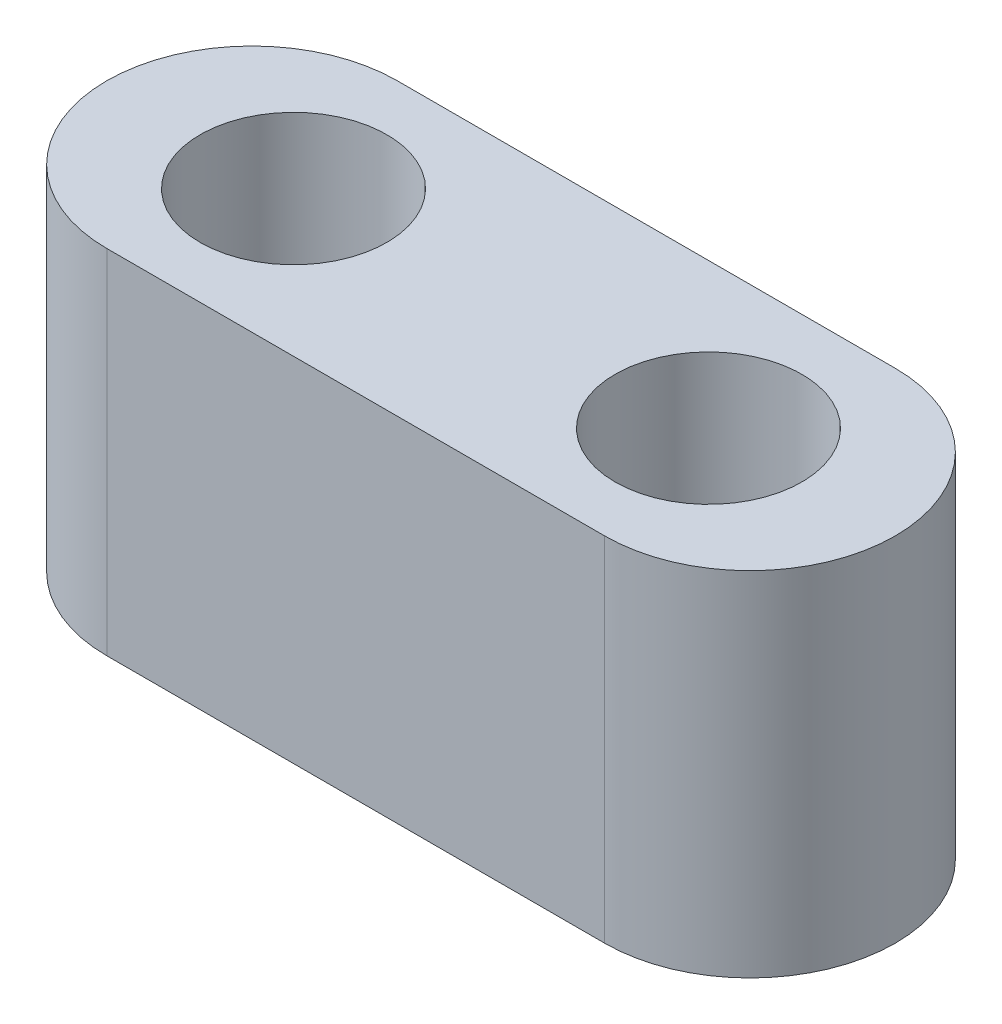
ISO-10303-21;
HEADER;
FILE_DESCRIPTION(('STEP AP214'),'2;1');
FILE_NAME('part.step','',(''),(''),'','','');
FILE_SCHEMA(('AUTOMOTIVE_DESIGN { 1 0 10303 214 1 1 1 1 }'));
ENDSEC;
DATA;
#1=APPLICATION_CONTEXT('core data for automotive mechanical design processes');
#2=APPLICATION_PROTOCOL_DEFINITION('international standard','automotive_design',2000,#1);
#3=PRODUCT_CONTEXT('',#1,'mechanical');
#4=PRODUCT('Part','Part','',(#3));
#5=PRODUCT_RELATED_PRODUCT_CATEGORY('part','',(#4));
#6=PRODUCT_DEFINITION_FORMATION('','',#4);
#7=PRODUCT_DEFINITION_CONTEXT('part definition',#1,'design');
#8=PRODUCT_DEFINITION('design','',#6,#7);
#9=PRODUCT_DEFINITION_SHAPE('','',#8);
#10=(LENGTH_UNIT() NAMED_UNIT(*) SI_UNIT(.MILLI.,.METRE.));
#11=(NAMED_UNIT(*) PLANE_ANGLE_UNIT() SI_UNIT($,.RADIAN.));
#12=(NAMED_UNIT(*) SI_UNIT($,.STERADIAN.) SOLID_ANGLE_UNIT());
#13=UNCERTAINTY_MEASURE_WITH_UNIT(LENGTH_MEASURE(1.E-05),#10,'distance_accuracy_value','');
#14=(GEOMETRIC_REPRESENTATION_CONTEXT(3) GLOBAL_UNCERTAINTY_ASSIGNED_CONTEXT((#13)) GLOBAL_UNIT_ASSIGNED_CONTEXT((#10,
#11,#12)) REPRESENTATION_CONTEXT('',''));
#15=CARTESIAN_POINT('',(0.,0.,0.));
#16=DIRECTION('',(0.,0.,1.));
#17=DIRECTION('',(1.,0.,0.));
#18=AXIS2_PLACEMENT_3D('',#15,#16,#17);
#19=CARTESIAN_POINT('',(-6.,8.5,0.));
#20=DIRECTION('',(0.,1.,0.));
#21=DIRECTION('',(0.,0.,1.));
#22=AXIS2_PLACEMENT_3D('',#19,#20,#21);
#23=PLANE('',#22);
#24=CARTESIAN_POINT('',(5.,8.5,0.));
#25=DIRECTION('',(0.,1.,0.));
#26=DIRECTION('',(0.,0.,1.));
#27=AXIS2_PLACEMENT_3D('',#24,#25,#26);
#28=CIRCLE('',#27,2.25);
#29=CARTESIAN_POINT('',(5.,8.5,2.25));
#30=VERTEX_POINT('',#29);
#31=EDGE_CURVE('E116',#30,#30,#28,.T.);
#32=ORIENTED_EDGE('',*,*,#31,.F.);
#33=EDGE_LOOP('',(#32));
#34=FACE_BOUND('',#33,.T.);
#35=CARTESIAN_POINT('',(-6.,8.5,0.));
#36=DIRECTION('',(0.,1.,0.));
#37=DIRECTION('',(0.,0.,1.));
#38=AXIS2_PLACEMENT_3D('',#35,#36,#37);
#39=CIRCLE('',#38,3.5);
#40=CARTESIAN_POINT('',(-6.,8.5,-3.5));
#41=VERTEX_POINT('',#40);
#42=CARTESIAN_POINT('',(-6.,8.5,3.5));
#43=VERTEX_POINT('',#42);
#44=EDGE_CURVE('E96',#41,#43,#39,.T.);
#45=ORIENTED_EDGE('',*,*,#44,.T.);
#46=DIRECTION('',(1.,0.,0.));
#47=VECTOR('',#46,1.);
#48=CARTESIAN_POINT('',(-6.,8.5,3.5));
#49=LINE('',#48,#47);
#50=CARTESIAN_POINT('',(6.,8.5,3.5));
#51=VERTEX_POINT('',#50);
#52=EDGE_CURVE('E91',#43,#51,#49,.T.);
#53=ORIENTED_EDGE('',*,*,#52,.T.);
#54=CARTESIAN_POINT('',(6.,8.5,0.));
#55=DIRECTION('',(0.,1.,0.));
#56=DIRECTION('',(0.,0.,1.));
#57=AXIS2_PLACEMENT_3D('',#54,#55,#56);
#58=CIRCLE('',#57,3.5);
#59=CARTESIAN_POINT('',(6.,8.5,-3.5));
#60=VERTEX_POINT('',#59);
#61=EDGE_CURVE('E94',#51,#60,#58,.T.);
#62=ORIENTED_EDGE('',*,*,#61,.T.);
#63=DIRECTION('',(-1.,0.,0.));
#64=VECTOR('',#63,1.);
#65=CARTESIAN_POINT('',(-6.,8.5,-3.5));
#66=LINE('',#65,#64);
#67=EDGE_CURVE('E61',#60,#41,#66,.T.);
#68=ORIENTED_EDGE('',*,*,#67,.T.);
#69=EDGE_LOOP('',(#45,#53,#62,#68));
#70=FACE_BOUND('',#69,.T.);
#71=CARTESIAN_POINT('',(-5.,8.5,0.));
#72=DIRECTION('',(0.,1.,0.));
#73=DIRECTION('',(0.,0.,1.));
#74=AXIS2_PLACEMENT_3D('',#71,#72,#73);
#75=CIRCLE('',#74,2.25);
#76=CARTESIAN_POINT('',(-5.,8.5,2.25));
#77=VERTEX_POINT('',#76);
#78=EDGE_CURVE('E138',#77,#77,#75,.T.);
#79=ORIENTED_EDGE('',*,*,#78,.F.);
#80=EDGE_LOOP('',(#79));
#81=FACE_BOUND('',#80,.T.);
#82=ADVANCED_FACE('F43',(#34,#70,#81),#23,.T.);
#83=CARTESIAN_POINT('',(-6.,0.,0.));
#84=DIRECTION('',(0.,1.,0.));
#85=DIRECTION('',(0.,0.,1.));
#86=AXIS2_PLACEMENT_3D('',#83,#84,#85);
#87=PLANE('',#86);
#88=CARTESIAN_POINT('',(-6.,0.,0.));
#89=DIRECTION('',(0.,1.,0.));
#90=DIRECTION('',(0.,0.,1.));
#91=AXIS2_PLACEMENT_3D('',#88,#89,#90);
#92=CIRCLE('',#91,3.5);
#93=CARTESIAN_POINT('',(-6.,0.,-3.5));
#94=VERTEX_POINT('',#93);
#95=CARTESIAN_POINT('',(-6.,0.,3.5));
#96=VERTEX_POINT('',#95);
#97=EDGE_CURVE('E112',#94,#96,#92,.T.);
#98=ORIENTED_EDGE('',*,*,#97,.F.);
#99=DIRECTION('',(-1.,0.,0.));
#100=VECTOR('',#99,1.);
#101=CARTESIAN_POINT('',(-6.,0.,-3.5));
#102=LINE('',#101,#100);
#103=CARTESIAN_POINT('',(6.,0.,-3.5));
#104=VERTEX_POINT('',#103);
#105=EDGE_CURVE('E84',#104,#94,#102,.T.);
#106=ORIENTED_EDGE('',*,*,#105,.F.);
#107=CARTESIAN_POINT('',(6.,0.,0.));
#108=DIRECTION('',(0.,1.,0.));
#109=DIRECTION('',(0.,0.,1.));
#110=AXIS2_PLACEMENT_3D('',#107,#108,#109);
#111=CIRCLE('',#110,3.5);
#112=CARTESIAN_POINT('',(6.,0.,3.5));
#113=VERTEX_POINT('',#112);
#114=EDGE_CURVE('E78',#113,#104,#111,.T.);
#115=ORIENTED_EDGE('',*,*,#114,.F.);
#116=DIRECTION('',(1.,0.,0.));
#117=VECTOR('',#116,1.);
#118=CARTESIAN_POINT('',(-6.,0.,3.5));
#119=LINE('',#118,#117);
#120=EDGE_CURVE('E101',#96,#113,#119,.T.);
#121=ORIENTED_EDGE('',*,*,#120,.F.);
#122=EDGE_LOOP('',(#98,#106,#115,#121));
#123=FACE_BOUND('',#122,.T.);
#124=CARTESIAN_POINT('',(5.,0.,0.));
#125=DIRECTION('',(0.,1.,0.));
#126=DIRECTION('',(0.,0.,1.));
#127=AXIS2_PLACEMENT_3D('',#124,#125,#126);
#128=CIRCLE('',#127,2.25);
#129=CARTESIAN_POINT('',(5.,0.,2.25));
#130=VERTEX_POINT('',#129);
#131=EDGE_CURVE('E134',#130,#130,#128,.T.);
#132=ORIENTED_EDGE('',*,*,#131,.T.);
#133=EDGE_LOOP('',(#132));
#134=FACE_BOUND('',#133,.T.);
#135=CARTESIAN_POINT('',(-5.,0.,0.));
#136=DIRECTION('',(0.,1.,0.));
#137=DIRECTION('',(0.,0.,1.));
#138=AXIS2_PLACEMENT_3D('',#135,#136,#137);
#139=CIRCLE('',#138,2.25);
#140=CARTESIAN_POINT('',(-5.,0.,2.25));
#141=VERTEX_POINT('',#140);
#142=EDGE_CURVE('E142',#141,#141,#139,.T.);
#143=ORIENTED_EDGE('',*,*,#142,.T.);
#144=EDGE_LOOP('',(#143));
#145=FACE_BOUND('',#144,.T.);
#146=ADVANCED_FACE('F129',(#123,#134,#145),#87,.F.);
#147=CARTESIAN_POINT('',(-6.,8.5,0.));
#148=DIRECTION('',(0.,-1.,0.));
#149=DIRECTION('',(0.,0.,-1.));
#150=AXIS2_PLACEMENT_3D('',#147,#148,#149);
#151=CYLINDRICAL_SURFACE('',#150,3.5);
#152=ORIENTED_EDGE('',*,*,#97,.T.);
#153=DIRECTION('',(0.,-1.,0.));
#154=VECTOR('',#153,1.);
#155=CARTESIAN_POINT('',(-6.,8.5,3.5));
#156=LINE('',#155,#154);
#157=EDGE_CURVE('E11',#43,#96,#156,.T.);
#158=ORIENTED_EDGE('',*,*,#157,.F.);
#159=ORIENTED_EDGE('',*,*,#44,.F.);
#160=DIRECTION('',(0.,-1.,0.));
#161=VECTOR('',#160,1.);
#162=CARTESIAN_POINT('',(-6.,8.5,-3.5));
#163=LINE('',#162,#161);
#164=EDGE_CURVE('E108',#41,#94,#163,.T.);
#165=ORIENTED_EDGE('',*,*,#164,.T.);
#166=EDGE_LOOP('',(#152,#158,#159,#165));
#167=FACE_BOUND('',#166,.T.);
#168=ADVANCED_FACE('F45',(#167),#151,.T.);
#169=CARTESIAN_POINT('',(-6.,8.5,3.5));
#170=DIRECTION('',(0.,0.,-1.));
#171=DIRECTION('',(-1.,0.,0.));
#172=AXIS2_PLACEMENT_3D('',#169,#170,#171);
#173=PLANE('',#172);
#174=ORIENTED_EDGE('',*,*,#120,.T.);
#175=DIRECTION('',(0.,-1.,0.));
#176=VECTOR('',#175,1.);
#177=CARTESIAN_POINT('',(6.,8.5,3.5));
#178=LINE('',#177,#176);
#179=EDGE_CURVE('E53',#51,#113,#178,.T.);
#180=ORIENTED_EDGE('',*,*,#179,.F.);
#181=ORIENTED_EDGE('',*,*,#52,.F.);
#182=ORIENTED_EDGE('',*,*,#157,.T.);
#183=EDGE_LOOP('',(#174,#180,#181,#182));
#184=FACE_BOUND('',#183,.T.);
#185=ADVANCED_FACE('F100',(#184),#173,.F.);
#186=CARTESIAN_POINT('',(6.,8.5,0.));
#187=DIRECTION('',(0.,-1.,0.));
#188=DIRECTION('',(0.,0.,-1.));
#189=AXIS2_PLACEMENT_3D('',#186,#187,#188);
#190=CYLINDRICAL_SURFACE('',#189,3.5);
#191=ORIENTED_EDGE('',*,*,#114,.T.);
#192=DIRECTION('',(0.,-1.,0.));
#193=VECTOR('',#192,1.);
#194=CARTESIAN_POINT('',(6.,8.5,-3.5));
#195=LINE('',#194,#193);
#196=EDGE_CURVE('E103',#60,#104,#195,.T.);
#197=ORIENTED_EDGE('',*,*,#196,.F.);
#198=ORIENTED_EDGE('',*,*,#61,.F.);
#199=ORIENTED_EDGE('',*,*,#179,.T.);
#200=EDGE_LOOP('',(#191,#197,#198,#199));
#201=FACE_BOUND('',#200,.T.);
#202=ADVANCED_FACE('F104',(#201),#190,.T.);
#203=CARTESIAN_POINT('',(-6.,8.5,-3.5));
#204=DIRECTION('',(0.,0.,1.));
#205=DIRECTION('',(1.,0.,0.));
#206=AXIS2_PLACEMENT_3D('',#203,#204,#205);
#207=PLANE('',#206);
#208=ORIENTED_EDGE('',*,*,#105,.T.);
#209=ORIENTED_EDGE('',*,*,#164,.F.);
#210=ORIENTED_EDGE('',*,*,#67,.F.);
#211=ORIENTED_EDGE('',*,*,#196,.T.);
#212=EDGE_LOOP('',(#208,#209,#210,#211));
#213=FACE_BOUND('',#212,.T.);
#214=ADVANCED_FACE('F126',(#213),#207,.F.);
#215=CARTESIAN_POINT('',(5.,8.5,0.));
#216=DIRECTION('',(0.,-1.,0.));
#217=DIRECTION('',(0.,0.,-1.));
#218=AXIS2_PLACEMENT_3D('',#215,#216,#217);
#219=CYLINDRICAL_SURFACE('',#218,2.25);
#220=ORIENTED_EDGE('',*,*,#31,.T.);
#221=EDGE_LOOP('',(#220));
#222=FACE_BOUND('',#221,.T.);
#223=ORIENTED_EDGE('',*,*,#131,.F.);
#224=EDGE_LOOP('',(#223));
#225=FACE_BOUND('',#224,.T.);
#226=ADVANCED_FACE('F161',(#222,#225),#219,.F.);
#227=CARTESIAN_POINT('',(-5.,8.5,0.));
#228=DIRECTION('',(0.,-1.,0.));
#229=DIRECTION('',(0.,0.,-1.));
#230=AXIS2_PLACEMENT_3D('',#227,#228,#229);
#231=CYLINDRICAL_SURFACE('',#230,2.25);
#232=ORIENTED_EDGE('',*,*,#78,.T.);
#233=EDGE_LOOP('',(#232));
#234=FACE_BOUND('',#233,.T.);
#235=ORIENTED_EDGE('',*,*,#142,.F.);
#236=EDGE_LOOP('',(#235));
#237=FACE_BOUND('',#236,.T.);
#238=ADVANCED_FACE('F150',(#234,#237),#231,.F.);
#239=CLOSED_SHELL('',(#82,#146,#168,#185,#202,#214,#226,#238));
#240=MANIFOLD_SOLID_BREP('B2',#239);
#241=ADVANCED_BREP_SHAPE_REPRESENTATION('',(#18,#240),#14);
#242=SHAPE_DEFINITION_REPRESENTATION(#9,#241);
ENDSEC;
END-ISO-10303-21;
